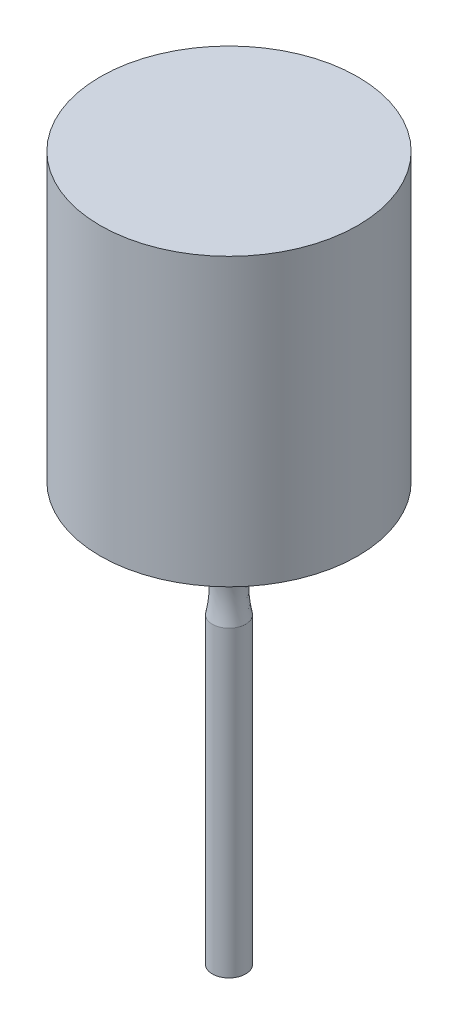
ISO-10303-21;
HEADER;
FILE_DESCRIPTION(('STEP AP214'),'2;1');
FILE_NAME('part.step','',(''),(''),'','','');
FILE_SCHEMA(('AUTOMOTIVE_DESIGN { 1 0 10303 214 1 1 1 1 }'));
ENDSEC;
DATA;
#1=APPLICATION_CONTEXT('core data for automotive mechanical design processes');
#2=APPLICATION_PROTOCOL_DEFINITION('international standard','automotive_design',2000,#1);
#3=PRODUCT_CONTEXT('',#1,'mechanical');
#4=PRODUCT('Part','Part','',(#3));
#5=PRODUCT_RELATED_PRODUCT_CATEGORY('part','',(#4));
#6=PRODUCT_DEFINITION_FORMATION('','',#4);
#7=PRODUCT_DEFINITION_CONTEXT('part definition',#1,'design');
#8=PRODUCT_DEFINITION('design','',#6,#7);
#9=PRODUCT_DEFINITION_SHAPE('','',#8);
#10=(LENGTH_UNIT() NAMED_UNIT(*) SI_UNIT(.MILLI.,.METRE.));
#11=(NAMED_UNIT(*) PLANE_ANGLE_UNIT() SI_UNIT($,.RADIAN.));
#12=(NAMED_UNIT(*) SI_UNIT($,.STERADIAN.) SOLID_ANGLE_UNIT());
#13=UNCERTAINTY_MEASURE_WITH_UNIT(LENGTH_MEASURE(1.E-05),#10,'distance_accuracy_value','');
#14=(GEOMETRIC_REPRESENTATION_CONTEXT(3) GLOBAL_UNCERTAINTY_ASSIGNED_CONTEXT((#13)) GLOBAL_UNIT_ASSIGNED_CONTEXT((#10,
#11,#12)) REPRESENTATION_CONTEXT('',''));
#15=CARTESIAN_POINT('',(0.,0.,0.));
#16=DIRECTION('',(0.,0.,1.));
#17=DIRECTION('',(1.,0.,0.));
#18=AXIS2_PLACEMENT_3D('',#15,#16,#17);
#19=CARTESIAN_POINT('',(0.,60.,0.));
#20=DIRECTION('',(0.,-1.,0.));
#21=DIRECTION('',(0.,0.,-1.));
#22=AXIS2_PLACEMENT_3D('',#19,#20,#21);
#23=CYLINDRICAL_SURFACE('',#22,27.);
#24=CARTESIAN_POINT('',(0.,60.,0.));
#25=DIRECTION('',(0.,1.,0.));
#26=DIRECTION('',(0.,0.,1.));
#27=AXIS2_PLACEMENT_3D('',#24,#25,#26);
#28=CIRCLE('',#27,27.);
#29=CARTESIAN_POINT('',(0.,60.,27.));
#30=VERTEX_POINT('',#29);
#31=EDGE_CURVE('E11',#30,#30,#28,.T.);
#32=ORIENTED_EDGE('',*,*,#31,.F.);
#33=EDGE_LOOP('',(#32));
#34=FACE_BOUND('',#33,.T.);
#35=CARTESIAN_POINT('',(0.,0.,0.));
#36=DIRECTION('',(0.,1.,0.));
#37=DIRECTION('',(0.,0.,1.));
#38=AXIS2_PLACEMENT_3D('',#35,#36,#37);
#39=CIRCLE('',#38,27.);
#40=CARTESIAN_POINT('',(0.,0.,27.));
#41=VERTEX_POINT('',#40);
#42=EDGE_CURVE('E55',#41,#41,#39,.T.);
#43=ORIENTED_EDGE('',*,*,#42,.T.);
#44=EDGE_LOOP('',(#43));
#45=FACE_BOUND('',#44,.T.);
#46=ADVANCED_FACE('F47',(#34,#45),#23,.T.);
#47=CARTESIAN_POINT('',(0.,60.,0.));
#48=DIRECTION('',(0.,1.,0.));
#49=DIRECTION('',(0.,0.,1.));
#50=AXIS2_PLACEMENT_3D('',#47,#48,#49);
#51=PLANE('',#50);
#52=ORIENTED_EDGE('',*,*,#31,.T.);
#53=EDGE_LOOP('',(#52));
#54=FACE_BOUND('',#53,.T.);
#55=ADVANCED_FACE('F165',(#54),#51,.T.);
#56=CARTESIAN_POINT('',(0.,0.,0.));
#57=DIRECTION('',(0.,1.,0.));
#58=DIRECTION('',(0.,0.,1.));
#59=AXIS2_PLACEMENT_3D('',#56,#57,#58);
#60=PLANE('',#59);
#61=CARTESIAN_POINT('',(0.,0.,0.));
#62=DIRECTION('',(0.,-1.,0.));
#63=DIRECTION('',(0.,0.,-1.));
#64=AXIS2_PLACEMENT_3D('',#61,#62,#63);
#65=CIRCLE('',#64,25.527);
#66=CARTESIAN_POINT('',(0.,0.,-25.527));
#67=VERTEX_POINT('',#66);
#68=EDGE_CURVE('E63',#67,#67,#65,.T.);
#69=ORIENTED_EDGE('',*,*,#68,.F.);
#70=EDGE_LOOP('',(#69));
#71=FACE_BOUND('',#70,.T.);
#72=ORIENTED_EDGE('',*,*,#42,.F.);
#73=EDGE_LOOP('',(#72));
#74=FACE_BOUND('',#73,.T.);
#75=ADVANCED_FACE('F162',(#71,#74),#60,.F.);
#76=CARTESIAN_POINT('',(0.,1.9558,0.));
#77=DIRECTION('',(0.,-1.,0.));
#78=DIRECTION('',(0.,0.,-1.));
#79=AXIS2_PLACEMENT_3D('',#76,#77,#78);
#80=CYLINDRICAL_SURFACE('',#79,25.527);
#81=CARTESIAN_POINT('',(0.,1.9558,0.));
#82=DIRECTION('',(0.,-1.,0.));
#83=DIRECTION('',(0.,0.,-1.));
#84=AXIS2_PLACEMENT_3D('',#81,#82,#83);
#85=CIRCLE('',#84,25.527);
#86=CARTESIAN_POINT('',(0.,1.9558,-25.527));
#87=VERTEX_POINT('',#86);
#88=EDGE_CURVE('E60',#87,#87,#85,.T.);
#89=ORIENTED_EDGE('',*,*,#88,.F.);
#90=EDGE_LOOP('',(#89));
#91=FACE_BOUND('',#90,.T.);
#92=ORIENTED_EDGE('',*,*,#68,.T.);
#93=EDGE_LOOP('',(#92));
#94=FACE_BOUND('',#93,.T.);
#95=ADVANCED_FACE('F160',(#91,#94),#80,.F.);
#96=CARTESIAN_POINT('',(0.,1.9558,0.));
#97=DIRECTION('',(0.,-1.,0.));
#98=DIRECTION('',(0.,0.,-1.));
#99=AXIS2_PLACEMENT_3D('',#96,#97,#98);
#100=PLANE('',#99);
#101=CARTESIAN_POINT('',(0.,1.9558,0.));
#102=DIRECTION('',(0.,-1.,0.));
#103=DIRECTION('',(0.,0.,-1.));
#104=AXIS2_PLACEMENT_3D('',#101,#102,#103);
#105=CIRCLE('',#104,22.0345);
#106=CARTESIAN_POINT('',(0.,1.9558,-22.0345));
#107=VERTEX_POINT('',#106);
#108=EDGE_CURVE('E150',#107,#107,#105,.T.);
#109=ORIENTED_EDGE('',*,*,#108,.F.);
#110=EDGE_LOOP('',(#109));
#111=FACE_BOUND('',#110,.T.);
#112=ORIENTED_EDGE('',*,*,#88,.T.);
#113=EDGE_LOOP('',(#112));
#114=FACE_BOUND('',#113,.T.);
#115=ADVANCED_FACE('F180',(#111,#114),#100,.T.);
#116=CARTESIAN_POINT('',(0.,1.9558,0.));
#117=DIRECTION('',(0.,-1.,0.));
#118=DIRECTION('',(0.,0.,-1.));
#119=AXIS2_PLACEMENT_3D('',#116,#117,#118);
#120=CYLINDRICAL_SURFACE('',#119,22.0345);
#121=ORIENTED_EDGE('',*,*,#108,.T.);
#122=EDGE_LOOP('',(#121));
#123=FACE_BOUND('',#122,.T.);
#124=CARTESIAN_POINT('',(0.,0.,0.));
#125=DIRECTION('',(0.,-1.,0.));
#126=DIRECTION('',(0.,0.,-1.));
#127=AXIS2_PLACEMENT_3D('',#124,#125,#126);
#128=CIRCLE('',#127,22.0345);
#129=CARTESIAN_POINT('',(0.,0.,-22.0345));
#130=VERTEX_POINT('',#129);
#131=EDGE_CURVE('E117',#130,#130,#128,.T.);
#132=ORIENTED_EDGE('',*,*,#131,.F.);
#133=EDGE_LOOP('',(#132));
#134=FACE_BOUND('',#133,.T.);
#135=ADVANCED_FACE('F184',(#123,#134),#120,.T.);
#136=CARTESIAN_POINT('',(0.,0.,0.));
#137=DIRECTION('',(0.,-1.,0.));
#138=DIRECTION('',(0.,0.,-1.));
#139=AXIS2_PLACEMENT_3D('',#136,#137,#138);
#140=CIRCLE('',#139,7.62);
#141=CARTESIAN_POINT('',(0.,0.,-7.62));
#142=VERTEX_POINT('',#141);
#143=EDGE_CURVE('E110',#142,#142,#140,.T.);
#144=ORIENTED_EDGE('',*,*,#143,.F.);
#145=EDGE_LOOP('',(#144));
#146=FACE_BOUND('',#145,.T.);
#147=CARTESIAN_POINT('',(0.,0.,17.));
#148=DIRECTION('',(0.,-1.,0.));
#149=DIRECTION('',(0.,0.,-1.));
#150=AXIS2_PLACEMENT_3D('',#147,#148,#149);
#151=CIRCLE('',#150,2.);
#152=CARTESIAN_POINT('',(0.,0.,15.));
#153=VERTEX_POINT('',#152);
#154=EDGE_CURVE('E118',#153,#153,#151,.T.);
#155=ORIENTED_EDGE('',*,*,#154,.F.);
#156=EDGE_LOOP('',(#155));
#157=FACE_BOUND('',#156,.T.);
#158=CARTESIAN_POINT('',(-14.7224318643351,0.,8.49999999999936));
#159=DIRECTION('',(0.,-1.,0.));
#160=DIRECTION('',(0.,0.,-1.));
#161=AXIS2_PLACEMENT_3D('',#158,#159,#160);
#162=CIRCLE('',#161,2.00000000000073);
#163=CARTESIAN_POINT('',(-14.7224318643351,0.,6.49999999999863));
#164=VERTEX_POINT('',#163);
#165=EDGE_CURVE('E113',#164,#164,#162,.T.);
#166=ORIENTED_EDGE('',*,*,#165,.F.);
#167=EDGE_LOOP('',(#166));
#168=FACE_BOUND('',#167,.T.);
#169=CARTESIAN_POINT('',(-14.7224318643344,0.,-8.50000000000063));
#170=DIRECTION('',(0.,-1.,0.));
#171=DIRECTION('',(0.,0.,-1.));
#172=AXIS2_PLACEMENT_3D('',#169,#170,#171);
#173=CIRCLE('',#172,2.00000000000138);
#174=CARTESIAN_POINT('',(-14.7224318643344,0.,-10.500000000002));
#175=VERTEX_POINT('',#174);
#176=EDGE_CURVE('E125',#175,#175,#173,.T.);
#177=ORIENTED_EDGE('',*,*,#176,.F.);
#178=EDGE_LOOP('',(#177));
#179=FACE_BOUND('',#178,.T.);
#180=CARTESIAN_POINT('',(1.4453433818335E-12,0.,-17.));
#181=DIRECTION('',(0.,-1.,0.));
#182=DIRECTION('',(0.,0.,-1.));
#183=AXIS2_PLACEMENT_3D('',#180,#181,#182);
#184=CIRCLE('',#183,2.0000000000015);
#185=CARTESIAN_POINT('',(1.4453433818335E-12,0.,-19.0000000000015));
#186=VERTEX_POINT('',#185);
#187=EDGE_CURVE('E142',#186,#186,#184,.T.);
#188=ORIENTED_EDGE('',*,*,#187,.F.);
#189=EDGE_LOOP('',(#188));
#190=FACE_BOUND('',#189,.T.);
#191=CARTESIAN_POINT('',(14.7224318643365,0.,-8.49999999999937));
#192=DIRECTION('',(0.,-1.,0.));
#193=DIRECTION('',(0.,0.,-1.));
#194=AXIS2_PLACEMENT_3D('',#191,#192,#193);
#195=CIRCLE('',#194,2.00000000000093);
#196=CARTESIAN_POINT('',(14.7224318643365,0.,-10.5000000000003));
#197=VERTEX_POINT('',#196);
#198=EDGE_CURVE('E136',#197,#197,#195,.T.);
#199=ORIENTED_EDGE('',*,*,#198,.F.);
#200=EDGE_LOOP('',(#199));
#201=FACE_BOUND('',#200,.T.);
#202=CARTESIAN_POINT('',(14.7224318643358,0.,8.50000000000063));
#203=DIRECTION('',(0.,-1.,0.));
#204=DIRECTION('',(0.,0.,-1.));
#205=AXIS2_PLACEMENT_3D('',#202,#203,#204);
#206=CIRCLE('',#205,2.00000000000021);
#207=CARTESIAN_POINT('',(14.7224318643358,0.,6.50000000000043));
#208=VERTEX_POINT('',#207);
#209=EDGE_CURVE('E130',#208,#208,#206,.T.);
#210=ORIENTED_EDGE('',*,*,#209,.F.);
#211=EDGE_LOOP('',(#210));
#212=FACE_BOUND('',#211,.T.);
#213=ORIENTED_EDGE('',*,*,#131,.T.);
#214=EDGE_LOOP('',(#213));
#215=FACE_BOUND('',#214,.T.);
#216=ADVANCED_FACE('F166',(#146,#157,#168,#179,#190,#201,#212,#215),#60,.F.);
#217=CARTESIAN_POINT('',(14.7224318643358,8.,8.50000000000063));
#218=DIRECTION('',(0.,-1.,0.));
#219=DIRECTION('',(0.,0.,-1.));
#220=AXIS2_PLACEMENT_3D('',#217,#218,#219);
#221=CYLINDRICAL_SURFACE('',#220,2.00000000000021);
#222=CARTESIAN_POINT('',(14.7224318643358,8.,8.50000000000063));
#223=DIRECTION('',(0.,-1.,0.));
#224=DIRECTION('',(0.,0.,-1.));
#225=AXIS2_PLACEMENT_3D('',#222,#223,#224);
#226=CIRCLE('',#225,2.00000000000021);
#227=CARTESIAN_POINT('',(14.7224318643358,8.,6.50000000000043));
#228=VERTEX_POINT('',#227);
#229=EDGE_CURVE('E121',#228,#228,#226,.T.);
#230=ORIENTED_EDGE('',*,*,#229,.F.);
#231=EDGE_LOOP('',(#230));
#232=FACE_BOUND('',#231,.T.);
#233=ORIENTED_EDGE('',*,*,#209,.T.);
#234=EDGE_LOOP('',(#233));
#235=FACE_BOUND('',#234,.T.);
#236=ADVANCED_FACE('F215',(#232,#235),#221,.F.);
#237=CARTESIAN_POINT('',(14.7224318643358,8.,8.50000000000063));
#238=DIRECTION('',(0.,-1.,0.));
#239=DIRECTION('',(0.,0.,-1.));
#240=AXIS2_PLACEMENT_3D('',#237,#238,#239);
#241=PLANE('',#240);
#242=ORIENTED_EDGE('',*,*,#229,.T.);
#243=EDGE_LOOP('',(#242));
#244=FACE_BOUND('',#243,.T.);
#245=ADVANCED_FACE('F210',(#244),#241,.T.);
#246=CARTESIAN_POINT('',(14.7224318643365,8.,-8.49999999999937));
#247=DIRECTION('',(0.,-1.,0.));
#248=DIRECTION('',(0.,0.,-1.));
#249=AXIS2_PLACEMENT_3D('',#246,#247,#248);
#250=CYLINDRICAL_SURFACE('',#249,2.00000000000093);
#251=CARTESIAN_POINT('',(14.7224318643365,8.,-8.49999999999937));
#252=DIRECTION('',(0.,-1.,0.));
#253=DIRECTION('',(0.,0.,-1.));
#254=AXIS2_PLACEMENT_3D('',#251,#252,#253);
#255=CIRCLE('',#254,2.00000000000093);
#256=CARTESIAN_POINT('',(14.7224318643365,8.,-10.5000000000003));
#257=VERTEX_POINT('',#256);
#258=EDGE_CURVE('E133',#257,#257,#255,.T.);
#259=ORIENTED_EDGE('',*,*,#258,.F.);
#260=EDGE_LOOP('',(#259));
#261=FACE_BOUND('',#260,.T.);
#262=ORIENTED_EDGE('',*,*,#198,.T.);
#263=EDGE_LOOP('',(#262));
#264=FACE_BOUND('',#263,.T.);
#265=ADVANCED_FACE('F207',(#261,#264),#250,.F.);
#266=CARTESIAN_POINT('',(14.7224318643365,8.,-8.49999999999937));
#267=DIRECTION('',(0.,-1.,0.));
#268=DIRECTION('',(0.,0.,-1.));
#269=AXIS2_PLACEMENT_3D('',#266,#267,#268);
#270=PLANE('',#269);
#271=ORIENTED_EDGE('',*,*,#258,.T.);
#272=EDGE_LOOP('',(#271));
#273=FACE_BOUND('',#272,.T.);
#274=ADVANCED_FACE('F202',(#273),#270,.T.);
#275=CARTESIAN_POINT('',(1.4453433818335E-12,8.,-17.));
#276=DIRECTION('',(0.,-1.,0.));
#277=DIRECTION('',(0.,0.,-1.));
#278=AXIS2_PLACEMENT_3D('',#275,#276,#277);
#279=CYLINDRICAL_SURFACE('',#278,2.0000000000015);
#280=CARTESIAN_POINT('',(1.4453433818335E-12,8.,-17.));
#281=DIRECTION('',(0.,-1.,0.));
#282=DIRECTION('',(0.,0.,-1.));
#283=AXIS2_PLACEMENT_3D('',#280,#281,#282);
#284=CIRCLE('',#283,2.0000000000015);
#285=CARTESIAN_POINT('',(1.4453433818335E-12,8.,-19.0000000000015));
#286=VERTEX_POINT('',#285);
#287=EDGE_CURVE('E139',#286,#286,#284,.T.);
#288=ORIENTED_EDGE('',*,*,#287,.F.);
#289=EDGE_LOOP('',(#288));
#290=FACE_BOUND('',#289,.T.);
#291=ORIENTED_EDGE('',*,*,#187,.T.);
#292=EDGE_LOOP('',(#291));
#293=FACE_BOUND('',#292,.T.);
#294=ADVANCED_FACE('F199',(#290,#293),#279,.F.);
#295=CARTESIAN_POINT('',(1.4453433818335E-12,8.,-17.));
#296=DIRECTION('',(0.,-1.,0.));
#297=DIRECTION('',(0.,0.,-1.));
#298=AXIS2_PLACEMENT_3D('',#295,#296,#297);
#299=PLANE('',#298);
#300=ORIENTED_EDGE('',*,*,#287,.T.);
#301=EDGE_LOOP('',(#300));
#302=FACE_BOUND('',#301,.T.);
#303=ADVANCED_FACE('F193',(#302),#299,.T.);
#304=CARTESIAN_POINT('',(-14.7224318643344,8.,-8.50000000000063));
#305=DIRECTION('',(0.,-1.,0.));
#306=DIRECTION('',(0.,0.,-1.));
#307=AXIS2_PLACEMENT_3D('',#304,#305,#306);
#308=CYLINDRICAL_SURFACE('',#307,2.00000000000138);
#309=CARTESIAN_POINT('',(-14.7224318643344,8.,-8.50000000000063));
#310=DIRECTION('',(0.,-1.,0.));
#311=DIRECTION('',(0.,0.,-1.));
#312=AXIS2_PLACEMENT_3D('',#309,#310,#311);
#313=CIRCLE('',#312,2.00000000000138);
#314=CARTESIAN_POINT('',(-14.7224318643344,8.,-10.500000000002));
#315=VERTEX_POINT('',#314);
#316=EDGE_CURVE('E145',#315,#315,#313,.T.);
#317=ORIENTED_EDGE('',*,*,#316,.F.);
#318=EDGE_LOOP('',(#317));
#319=FACE_BOUND('',#318,.T.);
#320=ORIENTED_EDGE('',*,*,#176,.T.);
#321=EDGE_LOOP('',(#320));
#322=FACE_BOUND('',#321,.T.);
#323=ADVANCED_FACE('F189',(#319,#322),#308,.F.);
#324=CARTESIAN_POINT('',(-14.7224318643344,8.,-8.50000000000063));
#325=DIRECTION('',(0.,-1.,0.));
#326=DIRECTION('',(0.,0.,-1.));
#327=AXIS2_PLACEMENT_3D('',#324,#325,#326);
#328=PLANE('',#327);
#329=ORIENTED_EDGE('',*,*,#316,.T.);
#330=EDGE_LOOP('',(#329));
#331=FACE_BOUND('',#330,.T.);
#332=ADVANCED_FACE('F192',(#331),#328,.T.);
#333=CARTESIAN_POINT('',(-14.7224318643351,8.,8.49999999999936));
#334=DIRECTION('',(0.,-1.,0.));
#335=DIRECTION('',(0.,0.,-1.));
#336=AXIS2_PLACEMENT_3D('',#333,#334,#335);
#337=CYLINDRICAL_SURFACE('',#336,2.00000000000073);
#338=CARTESIAN_POINT('',(-14.7224318643351,8.,8.49999999999936));
#339=DIRECTION('',(0.,-1.,0.));
#340=DIRECTION('',(0.,0.,-1.));
#341=AXIS2_PLACEMENT_3D('',#338,#339,#340);
#342=CIRCLE('',#341,2.00000000000073);
#343=CARTESIAN_POINT('',(-14.7224318643351,8.,6.49999999999863));
#344=VERTEX_POINT('',#343);
#345=EDGE_CURVE('E122',#344,#344,#342,.T.);
#346=ORIENTED_EDGE('',*,*,#345,.F.);
#347=EDGE_LOOP('',(#346));
#348=FACE_BOUND('',#347,.T.);
#349=ORIENTED_EDGE('',*,*,#165,.T.);
#350=EDGE_LOOP('',(#349));
#351=FACE_BOUND('',#350,.T.);
#352=ADVANCED_FACE('F197',(#348,#351),#337,.F.);
#353=CARTESIAN_POINT('',(-14.7224318643351,8.,8.49999999999936));
#354=DIRECTION('',(0.,-1.,0.));
#355=DIRECTION('',(0.,0.,-1.));
#356=AXIS2_PLACEMENT_3D('',#353,#354,#355);
#357=PLANE('',#356);
#358=ORIENTED_EDGE('',*,*,#345,.T.);
#359=EDGE_LOOP('',(#358));
#360=FACE_BOUND('',#359,.T.);
#361=ADVANCED_FACE('F224',(#360),#357,.T.);
#362=CARTESIAN_POINT('',(0.,8.,17.));
#363=DIRECTION('',(0.,-1.,0.));
#364=DIRECTION('',(0.,0.,-1.));
#365=AXIS2_PLACEMENT_3D('',#362,#363,#364);
#366=CYLINDRICAL_SURFACE('',#365,2.);
#367=CARTESIAN_POINT('',(0.,8.,17.));
#368=DIRECTION('',(0.,-1.,0.));
#369=DIRECTION('',(0.,0.,-1.));
#370=AXIS2_PLACEMENT_3D('',#367,#368,#369);
#371=CIRCLE('',#370,2.);
#372=CARTESIAN_POINT('',(0.,8.,15.));
#373=VERTEX_POINT('',#372);
#374=EDGE_CURVE('E114',#373,#373,#371,.T.);
#375=ORIENTED_EDGE('',*,*,#374,.F.);
#376=EDGE_LOOP('',(#375));
#377=FACE_BOUND('',#376,.T.);
#378=ORIENTED_EDGE('',*,*,#154,.T.);
#379=EDGE_LOOP('',(#378));
#380=FACE_BOUND('',#379,.T.);
#381=ADVANCED_FACE('F227',(#377,#380),#366,.F.);
#382=CARTESIAN_POINT('',(0.,8.,17.));
#383=DIRECTION('',(0.,-1.,0.));
#384=DIRECTION('',(0.,0.,-1.));
#385=AXIS2_PLACEMENT_3D('',#382,#383,#384);
#386=PLANE('',#385);
#387=ORIENTED_EDGE('',*,*,#374,.T.);
#388=EDGE_LOOP('',(#387));
#389=FACE_BOUND('',#388,.T.);
#390=ADVANCED_FACE('F90',(#389),#386,.T.);
#391=CARTESIAN_POINT('',(-3.43348336221723,-24.13,0.639334225094738));
#392=CARTESIAN_POINT('',(0.,0.,-7.62));
#393=CARTESIAN_POINT('',(-2.15481491202775,-24.13,7.50630094952919));
#394=CARTESIAN_POINT('',(-15.24,0.,-7.62));
#395=CARTESIAN_POINT('',(4.7121518124067,-24.13,6.22763249933972));
#396=CARTESIAN_POINT('',(-15.24,0.,7.62));
#397=CARTESIAN_POINT('',(3.43348336221723,-24.13,-0.639334225094738));
#398=CARTESIAN_POINT('',(0.,0.,7.62));
#399=CARTESIAN_POINT('',(2.15481491202775,-24.13,-7.50630094952918));
#400=CARTESIAN_POINT('',(15.24,0.,7.62));
#401=CARTESIAN_POINT('',(-4.7121518124067,-24.13,-6.22763249933971));
#402=CARTESIAN_POINT('',(15.24,0.,-7.62));
#403=CARTESIAN_POINT('',(-3.43348336221723,-24.13,0.639334225094738));
#404=CARTESIAN_POINT('',(0.,0.,-7.62));
#405=(BOUNDED_SURFACE() B_SPLINE_SURFACE(3,1,((#391,#392),(#393,#394),(#395,#396),(#397,#398),
(#399,#400),(#401,#402),(#403,#404)),.UNSPECIFIED.,.T.,.F.,.F.) B_SPLINE_SURFACE_WITH_KNOTS((4,
3,4),(2,2),(0.,0.5,1.),(0.,1.),
.UNSPECIFIED.) GEOMETRIC_REPRESENTATION_ITEM() RATIONAL_B_SPLINE_SURFACE(((1.,1.),
(0.333333333333333,0.333333333333333),(0.333333333333333,0.333333333333333),(1.,1.),
(0.333333333333334,0.333333333333333),(0.333333333333334,0.333333333333333),(1.,1.))) REPRESENTATION_ITEM('') SURFACE());
#406=CARTESIAN_POINT('',(0.,-24.13,0.));
#407=DIRECTION('',(0.,-1.,0.));
#408=DIRECTION('',(0.,0.,-1.));
#409=AXIS2_PLACEMENT_3D('',#406,#407,#408);
#410=CIRCLE('',#409,3.4925);
#411=CARTESIAN_POINT('',(-3.43348336221723,-24.13,0.639334225094738));
#412=VERTEX_POINT('',#411);
#413=EDGE_CURVE('E50',#412,#412,#410,.T.);
#414=CARTESIAN_POINT('',(-3.43348336221723,-24.13,0.639334225094738));
#415=CARTESIAN_POINT('',(-3.39771791052746,-23.8786458333333,0.553299493583335));
#416=CARTESIAN_POINT('',(-3.3619524588377,-23.6272916666667,0.467264762071931));
#417=CARTESIAN_POINT('',(-3.29042155545818,-23.1245833333333,0.295195299049124));
#418=CARTESIAN_POINT('',(-3.25465610376841,-22.8732291666667,0.209160567537721));
#419=CARTESIAN_POINT('',(-3.18312520038889,-22.3705208333333,0.0370911045149139));
#420=CARTESIAN_POINT('',(-3.14735974869913,-22.1191666666667,-0.0489436269964896));
#421=CARTESIAN_POINT('',(-3.0758288453196,-21.6164583333333,-0.221013090019297));
#422=CARTESIAN_POINT('',(-3.04006339362984,-21.3651041666667,-0.3070478215307));
#423=CARTESIAN_POINT('',(-2.96853249025031,-20.8623958333333,-0.479117284553507));
#424=CARTESIAN_POINT('',(-2.93276703856055,-20.6110416666667,-0.565152016064911));
#425=CARTESIAN_POINT('',(-2.86123613518102,-20.1083333333333,-0.737221479087718));
#426=CARTESIAN_POINT('',(-2.82547068349126,-19.8569791666667,-0.823256210599121));
#427=CARTESIAN_POINT('',(-2.75393978011173,-19.3542708333333,-0.995325673621928));
#428=CARTESIAN_POINT('',(-2.71817432842197,-19.1029166666667,-1.08136040513333));
#429=CARTESIAN_POINT('',(-2.64664342504245,-18.6002083333333,-1.25342986815614));
#430=CARTESIAN_POINT('',(-2.61087797335268,-18.3488541666667,-1.33946459966754));
#431=CARTESIAN_POINT('',(-2.53934706997316,-17.8461458333333,-1.51153406269035));
#432=CARTESIAN_POINT('',(-2.50358161828339,-17.5947916666667,-1.59756879420175));
#433=CARTESIAN_POINT('',(-2.43205071490387,-17.0920833333333,-1.76963825722456));
#434=CARTESIAN_POINT('',(-2.39628526321411,-16.8407291666667,-1.85567298873596));
#435=CARTESIAN_POINT('',(-2.32475435983458,-16.3380208333333,-2.02774245175877));
#436=CARTESIAN_POINT('',(-2.28898890814482,-16.0866666666667,-2.11377718327017));
#437=CARTESIAN_POINT('',(-2.21745800476529,-15.5839583333333,-2.28584664629298));
#438=CARTESIAN_POINT('',(-2.18169255307553,-15.3326041666667,-2.37188137780438));
#439=CARTESIAN_POINT('',(-2.110161649696,-14.8298958333333,-2.54395084082719));
#440=CARTESIAN_POINT('',(-2.07439619800624,-14.5785416666667,-2.6299855723386));
#441=CARTESIAN_POINT('',(-2.00286529462672,-14.0758333333333,-2.8020550353614));
#442=CARTESIAN_POINT('',(-1.96709984293695,-13.8244791666667,-2.88808976687281));
#443=CARTESIAN_POINT('',(-1.89556893955743,-13.3217708333333,-3.06015922989561));
#444=CARTESIAN_POINT('',(-1.85980348786766,-13.0704166666667,-3.14619396140702));
#445=CARTESIAN_POINT('',(-1.78827258448814,-12.5677083333333,-3.31826342442982));
#446=CARTESIAN_POINT('',(-1.75250713279838,-12.3163541666667,-3.40429815594123));
#447=CARTESIAN_POINT('',(-1.68097622941885,-11.8136458333333,-3.57636761896403));
#448=CARTESIAN_POINT('',(-1.64521077772909,-11.5622916666667,-3.66240235047544));
#449=CARTESIAN_POINT('',(-1.57367987434956,-11.0595833333333,-3.83447181349824));
#450=CARTESIAN_POINT('',(-1.5379144226598,-10.8082291666667,-3.92050654500965));
#451=CARTESIAN_POINT('',(-1.46638351928027,-10.3055208333333,-4.09257600803246));
#452=CARTESIAN_POINT('',(-1.43061806759051,-10.0541666666667,-4.17861073954386));
#453=CARTESIAN_POINT('',(-1.35908716421099,-9.55145833333333,-4.35068020256667));
#454=CARTESIAN_POINT('',(-1.32332171252122,-9.30010416666667,-4.43671493407807));
#455=CARTESIAN_POINT('',(-1.2517908091417,-8.79739583333333,-4.60878439710088));
#456=CARTESIAN_POINT('',(-1.21602535745193,-8.54604166666667,-4.69481912861228));
#457=CARTESIAN_POINT('',(-1.14449445407241,-8.04333333333333,-4.86688859163509));
#458=CARTESIAN_POINT('',(-1.10872900238265,-7.79197916666667,-4.95292332314649));
#459=CARTESIAN_POINT('',(-1.03719809900312,-7.28927083333333,-5.1249927861693));
#460=CARTESIAN_POINT('',(-1.00143264731336,-7.03791666666667,-5.2110275176807));
#461=CARTESIAN_POINT('',(-0.929901743933832,-6.53520833333333,-5.38309698070351));
#462=CARTESIAN_POINT('',(-0.894136292244069,-6.28385416666667,-5.46913171221491));
#463=CARTESIAN_POINT('',(-0.822605388864544,-5.78114583333333,-5.64120117523772));
#464=CARTESIAN_POINT('',(-0.786839937174781,-5.52979166666667,-5.72723590674912));
#465=CARTESIAN_POINT('',(-0.715309033795256,-5.02708333333333,-5.89930536977193));
#466=CARTESIAN_POINT('',(-0.679543582105493,-4.77572916666667,-5.98534010128333));
#467=CARTESIAN_POINT('',(-0.608012678725967,-4.27302083333333,-6.15740956430614));
#468=CARTESIAN_POINT('',(-0.572247227036204,-4.02166666666667,-6.24344429581754));
#469=CARTESIAN_POINT('',(-0.500716323656679,-3.51895833333333,-6.41551375884035));
#470=CARTESIAN_POINT('',(-0.464950871966916,-3.26760416666667,-6.50154849035175));
#471=CARTESIAN_POINT('',(-0.393419968587391,-2.76489583333333,-6.67361795337456));
#472=CARTESIAN_POINT('',(-0.357654516897628,-2.51354166666667,-6.75965268488596));
#473=CARTESIAN_POINT('',(-0.286123613518102,-2.01083333333333,-6.93172214790877));
#474=CARTESIAN_POINT('',(-0.250358161828339,-1.75947916666667,-7.01775687942017));
#475=CARTESIAN_POINT('',(-0.178827258448814,-1.25677083333333,-7.18982634244298));
#476=CARTESIAN_POINT('',(-0.143061806759051,-1.00541666666667,-7.27586107395438));
#477=CARTESIAN_POINT('',(-0.0715309033795256,-0.502708333333333,-7.44793053697719));
#478=CARTESIAN_POINT('',(-0.0357654516897628,-0.251354166666667,-7.5339652684886));
#479=CARTESIAN_POINT('',(0.,0.,-7.62));
#480=B_SPLINE_CURVE_WITH_KNOTS('',3,(#414,#415,#416,#417,#418,#419,#420,#421,#422,#423,#424,
#425,#426,#427,#428,#429,#430,#431,#432,#433,#434,#435,#436,#437,#438,#439,#440,#441,#442,#443,
#444,#445,#446,#447,#448,#449,#450,#451,#452,#453,#454,#455,#456,#457,#458,#459,#460,#461,#462,
#463,#464,#465,#466,#467,#468,#469,#470,#471,#472,#473,#474,#475,#476,#477,#478,#479),
.UNSPECIFIED.,.F.,.F.,(4,2,2,2,2,2,2,2,2,2,2,2,2,2,2,2,2,2,2,2,2,2,2,2,2,2,2,2,2,2,2,2,4),(0.,
0.804201801137972,1.60840360227594,2.41260540341392,3.21680720455189,4.02100900568986,
4.82521080682783,5.62941260796581,6.43361440910378,7.23781621024175,8.04201801137972,
8.84621981251769,9.65042161365566,10.4546234147936,11.2588252159316,12.0630270170696,
12.8672288182076,13.6714306193455,14.4756324204835,15.2798342216215,16.0840360227594,
16.8882378238974,17.6924396250354,18.4966414261734,19.3008432273113,20.1050450284493,
20.9092468295873,21.7134486307252,22.5176504318632,23.3218522330012,24.1260540341392,
24.9302558352771,25.7344576364151),.UNSPECIFIED.);
#481=EDGE_CURVE('BSEAM83',#412,#142,#480,.T.);
#482=ORIENTED_EDGE('',*,*,#413,.F.);
#483=ORIENTED_EDGE('',*,*,#143,.T.);
#484=ORIENTED_EDGE('',*,*,#481,.T.);
#485=ORIENTED_EDGE('',*,*,#481,.F.);
#486=EDGE_LOOP('',(#482,#484,#483,#485));
#487=FACE_BOUND('',#486,.T.);
#488=ADVANCED_FACE('F83',(#487),#405,.T.);
#489=CARTESIAN_POINT('',(0.,-87.63,0.));
#490=DIRECTION('',(0.,1.,0.));
#491=DIRECTION('',(0.,0.,1.));
#492=AXIS2_PLACEMENT_3D('',#489,#490,#491);
#493=CYLINDRICAL_SURFACE('',#492,3.4925);
#494=CARTESIAN_POINT('',(0.,-87.63,0.));
#495=DIRECTION('',(0.,-1.,0.));
#496=DIRECTION('',(0.,0.,-1.));
#497=AXIS2_PLACEMENT_3D('',#494,#495,#496);
#498=CIRCLE('',#497,3.4925);
#499=CARTESIAN_POINT('',(0.,-87.63,-3.4925));
#500=VERTEX_POINT('',#499);
#501=EDGE_CURVE('E341',#500,#500,#498,.T.);
#502=ORIENTED_EDGE('',*,*,#501,.F.);
#503=EDGE_LOOP('',(#502));
#504=FACE_BOUND('',#503,.T.);
#505=ORIENTED_EDGE('',*,*,#413,.T.);
#506=EDGE_LOOP('',(#505));
#507=FACE_BOUND('',#506,.T.);
#508=ADVANCED_FACE('F72',(#504,#507),#493,.T.);
#509=CARTESIAN_POINT('',(0.,-87.63,0.));
#510=DIRECTION('',(0.,-1.,0.));
#511=DIRECTION('',(0.,0.,-1.));
#512=AXIS2_PLACEMENT_3D('',#509,#510,#511);
#513=PLANE('',#512);
#514=ORIENTED_EDGE('',*,*,#501,.T.);
#515=EDGE_LOOP('',(#514));
#516=FACE_BOUND('',#515,.T.);
#517=ADVANCED_FACE('F82',(#516),#513,.T.);
#518=CLOSED_SHELL('',(#46,#55,#75,#95,#115,#135,#216,#236,#245,#265,#274,#294,#303,#323,#332,
#352,#361,#381,#390,#488,#508,#517));
#519=MANIFOLD_SOLID_BREP('B2',#518);
#520=ADVANCED_BREP_SHAPE_REPRESENTATION('',(#18,#519),#14);
#521=SHAPE_DEFINITION_REPRESENTATION(#9,#520);
ENDSEC;
END-ISO-10303-21;
